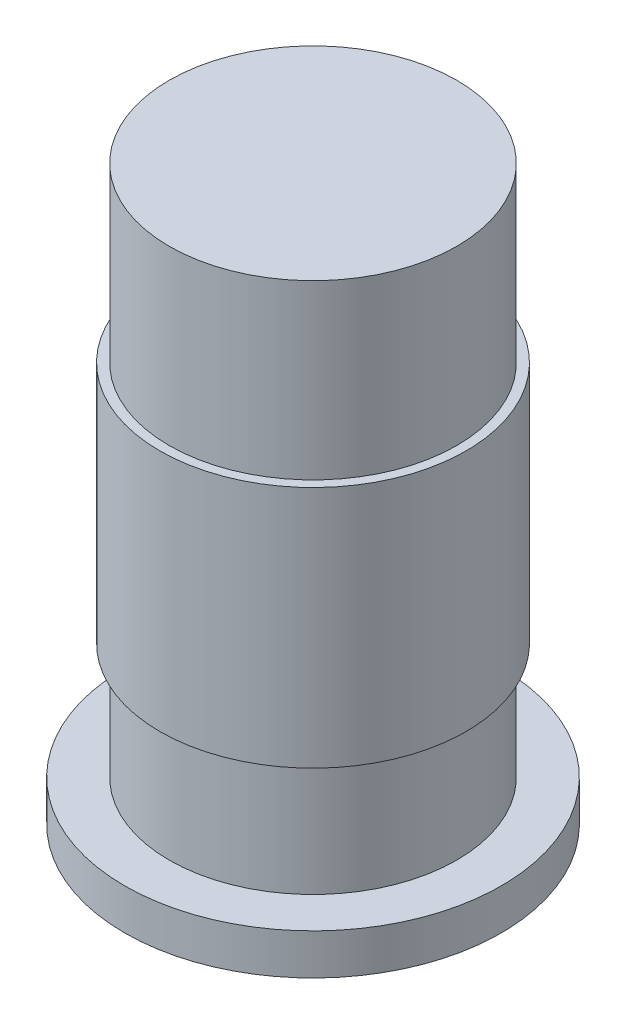
ISO-10303-21;
HEADER;
FILE_DESCRIPTION(('STEP AP214'),'2;1');
FILE_NAME('part.step','',(''),(''),'','','');
FILE_SCHEMA(('AUTOMOTIVE_DESIGN { 1 0 10303 214 1 1 1 1 }'));
ENDSEC;
DATA;
#1=APPLICATION_CONTEXT('core data for automotive mechanical design processes');
#2=APPLICATION_PROTOCOL_DEFINITION('international standard','automotive_design',2000,#1);
#3=PRODUCT_CONTEXT('',#1,'mechanical');
#4=PRODUCT('Part','Part','',(#3));
#5=PRODUCT_RELATED_PRODUCT_CATEGORY('part','',(#4));
#6=PRODUCT_DEFINITION_FORMATION('','',#4);
#7=PRODUCT_DEFINITION_CONTEXT('part definition',#1,'design');
#8=PRODUCT_DEFINITION('design','',#6,#7);
#9=PRODUCT_DEFINITION_SHAPE('','',#8);
#10=(LENGTH_UNIT() NAMED_UNIT(*) SI_UNIT(.MILLI.,.METRE.));
#11=(NAMED_UNIT(*) PLANE_ANGLE_UNIT() SI_UNIT($,.RADIAN.));
#12=(NAMED_UNIT(*) SI_UNIT($,.STERADIAN.) SOLID_ANGLE_UNIT());
#13=UNCERTAINTY_MEASURE_WITH_UNIT(LENGTH_MEASURE(1.E-05),#10,'distance_accuracy_value','');
#14=(GEOMETRIC_REPRESENTATION_CONTEXT(3) GLOBAL_UNCERTAINTY_ASSIGNED_CONTEXT((#13)) GLOBAL_UNIT_ASSIGNED_CONTEXT((#10,
#11,#12)) REPRESENTATION_CONTEXT('',''));
#15=CARTESIAN_POINT('',(0.,0.,0.));
#16=DIRECTION('',(0.,0.,1.));
#17=DIRECTION('',(1.,0.,0.));
#18=AXIS2_PLACEMENT_3D('',#15,#16,#17);
#19=CARTESIAN_POINT('',(0.,308.5,0.));
#20=DIRECTION('',(0.,-1.,0.));
#21=DIRECTION('',(0.,0.,-1.));
#22=AXIS2_PLACEMENT_3D('',#19,#20,#21);
#23=CYLINDRICAL_SURFACE('',#22,77.5);
#24=CARTESIAN_POINT('',(0.,22.,0.));
#25=DIRECTION('',(0.,1.,0.));
#26=DIRECTION('',(0.,0.,1.));
#27=AXIS2_PLACEMENT_3D('',#24,#25,#26);
#28=CIRCLE('',#27,77.5);
#29=CARTESIAN_POINT('',(0.,22.,77.5));
#30=VERTEX_POINT('',#29);
#31=EDGE_CURVE('E46',#30,#30,#28,.T.);
#32=ORIENTED_EDGE('',*,*,#31,.T.);
#33=EDGE_LOOP('',(#32));
#34=FACE_BOUND('',#33,.T.);
#35=CARTESIAN_POINT('',(0.,84.5,0.));
#36=DIRECTION('',(0.,1.,0.));
#37=DIRECTION('',(0.,0.,1.));
#38=AXIS2_PLACEMENT_3D('',#35,#36,#37);
#39=CIRCLE('',#38,77.5);
#40=CARTESIAN_POINT('',(0.,84.5,77.5));
#41=VERTEX_POINT('',#40);
#42=EDGE_CURVE('E10',#41,#41,#39,.T.);
#43=ORIENTED_EDGE('',*,*,#42,.F.);
#44=EDGE_LOOP('',(#43));
#45=FACE_BOUND('',#44,.T.);
#46=ADVANCED_FACE('F37',(#34,#45),#23,.T.);
#47=CARTESIAN_POINT('',(0.,22.,0.));
#48=DIRECTION('',(0.,-1.,0.));
#49=DIRECTION('',(0.,0.,-1.));
#50=AXIS2_PLACEMENT_3D('',#47,#48,#49);
#51=CYLINDRICAL_SURFACE('',#50,101.5);
#52=CARTESIAN_POINT('',(0.,22.,0.));
#53=DIRECTION('',(0.,1.,0.));
#54=DIRECTION('',(0.,0.,1.));
#55=AXIS2_PLACEMENT_3D('',#52,#53,#54);
#56=CIRCLE('',#55,101.5);
#57=CARTESIAN_POINT('',(0.,22.,101.5));
#58=VERTEX_POINT('',#57);
#59=EDGE_CURVE('E51',#58,#58,#56,.T.);
#60=ORIENTED_EDGE('',*,*,#59,.F.);
#61=EDGE_LOOP('',(#60));
#62=FACE_BOUND('',#61,.T.);
#63=CARTESIAN_POINT('',(0.,0.,0.));
#64=DIRECTION('',(0.,1.,0.));
#65=DIRECTION('',(0.,0.,1.));
#66=AXIS2_PLACEMENT_3D('',#63,#64,#65);
#67=CIRCLE('',#66,101.5);
#68=CARTESIAN_POINT('',(0.,0.,101.5));
#69=VERTEX_POINT('',#68);
#70=EDGE_CURVE('E54',#69,#69,#67,.T.);
#71=ORIENTED_EDGE('',*,*,#70,.T.);
#72=EDGE_LOOP('',(#71));
#73=FACE_BOUND('',#72,.T.);
#74=ADVANCED_FACE('F39',(#62,#73),#51,.T.);
#75=CARTESIAN_POINT('',(0.,22.,0.));
#76=DIRECTION('',(0.,1.,0.));
#77=DIRECTION('',(0.,0.,1.));
#78=AXIS2_PLACEMENT_3D('',#75,#76,#77);
#79=PLANE('',#78);
#80=ORIENTED_EDGE('',*,*,#31,.F.);
#81=EDGE_LOOP('',(#80));
#82=FACE_BOUND('',#81,.T.);
#83=ORIENTED_EDGE('',*,*,#59,.T.);
#84=EDGE_LOOP('',(#83));
#85=FACE_BOUND('',#84,.T.);
#86=ADVANCED_FACE('F101',(#82,#85),#79,.T.);
#87=CARTESIAN_POINT('',(0.,0.,0.));
#88=DIRECTION('',(0.,1.,0.));
#89=DIRECTION('',(0.,0.,1.));
#90=AXIS2_PLACEMENT_3D('',#87,#88,#89);
#91=PLANE('',#90);
#92=ORIENTED_EDGE('',*,*,#70,.F.);
#93=EDGE_LOOP('',(#92));
#94=FACE_BOUND('',#93,.T.);
#95=ADVANCED_FACE('F92',(#94),#91,.F.);
#96=CARTESIAN_POINT('',(0.,215.5,0.));
#97=DIRECTION('',(0.,-1.,0.));
#98=DIRECTION('',(0.,0.,-1.));
#99=AXIS2_PLACEMENT_3D('',#96,#97,#98);
#100=CYLINDRICAL_SURFACE('',#99,82.5);
#101=CARTESIAN_POINT('',(0.,215.5,0.));
#102=DIRECTION('',(0.,1.,0.));
#103=DIRECTION('',(0.,0.,1.));
#104=AXIS2_PLACEMENT_3D('',#101,#102,#103);
#105=CIRCLE('',#104,82.5);
#106=CARTESIAN_POINT('',(0.,215.5,82.5));
#107=VERTEX_POINT('',#106);
#108=EDGE_CURVE('E69',#107,#107,#105,.T.);
#109=ORIENTED_EDGE('',*,*,#108,.F.);
#110=EDGE_LOOP('',(#109));
#111=FACE_BOUND('',#110,.T.);
#112=CARTESIAN_POINT('',(0.,84.5,0.));
#113=DIRECTION('',(0.,1.,0.));
#114=DIRECTION('',(0.,0.,1.));
#115=AXIS2_PLACEMENT_3D('',#112,#113,#114);
#116=CIRCLE('',#115,82.5);
#117=CARTESIAN_POINT('',(0.,84.5,82.5));
#118=VERTEX_POINT('',#117);
#119=EDGE_CURVE('E65',#118,#118,#116,.T.);
#120=ORIENTED_EDGE('',*,*,#119,.T.);
#121=EDGE_LOOP('',(#120));
#122=FACE_BOUND('',#121,.T.);
#123=ADVANCED_FACE('F84',(#111,#122),#100,.T.);
#124=CARTESIAN_POINT('',(0.,215.5,0.));
#125=DIRECTION('',(0.,1.,0.));
#126=DIRECTION('',(0.,0.,1.));
#127=AXIS2_PLACEMENT_3D('',#124,#125,#126);
#128=PLANE('',#127);
#129=CARTESIAN_POINT('',(0.,215.5,0.));
#130=DIRECTION('',(0.,1.,0.));
#131=DIRECTION('',(0.,0.,1.));
#132=AXIS2_PLACEMENT_3D('',#129,#130,#131);
#133=CIRCLE('',#132,77.5);
#134=CARTESIAN_POINT('',(0.,215.5,77.5));
#135=VERTEX_POINT('',#134);
#136=EDGE_CURVE('E41',#135,#135,#133,.T.);
#137=ORIENTED_EDGE('',*,*,#136,.F.);
#138=EDGE_LOOP('',(#137));
#139=FACE_BOUND('',#138,.T.);
#140=ORIENTED_EDGE('',*,*,#108,.T.);
#141=EDGE_LOOP('',(#140));
#142=FACE_BOUND('',#141,.T.);
#143=ADVANCED_FACE('F81',(#139,#142),#128,.T.);
#144=CARTESIAN_POINT('',(0.,84.5,0.));
#145=DIRECTION('',(0.,1.,0.));
#146=DIRECTION('',(0.,0.,1.));
#147=AXIS2_PLACEMENT_3D('',#144,#145,#146);
#148=PLANE('',#147);
#149=ORIENTED_EDGE('',*,*,#42,.T.);
#150=EDGE_LOOP('',(#149));
#151=FACE_BOUND('',#150,.T.);
#152=ORIENTED_EDGE('',*,*,#119,.F.);
#153=EDGE_LOOP('',(#152));
#154=FACE_BOUND('',#153,.T.);
#155=ADVANCED_FACE('F83',(#151,#154),#148,.F.);
#156=CARTESIAN_POINT('',(0.,308.5,0.));
#157=DIRECTION('',(0.,1.,0.));
#158=DIRECTION('',(0.,0.,1.));
#159=AXIS2_PLACEMENT_3D('',#156,#157,#158);
#160=PLANE('',#159);
#161=CARTESIAN_POINT('',(0.,308.5,0.));
#162=DIRECTION('',(0.,1.,0.));
#163=DIRECTION('',(0.,0.,1.));
#164=AXIS2_PLACEMENT_3D('',#161,#162,#163);
#165=CIRCLE('',#164,77.5);
#166=CARTESIAN_POINT('',(0.,308.5,77.5));
#167=VERTEX_POINT('',#166);
#168=EDGE_CURVE('E58',#167,#167,#165,.T.);
#169=ORIENTED_EDGE('',*,*,#168,.T.);
#170=EDGE_LOOP('',(#169));
#171=FACE_BOUND('',#170,.T.);
#172=ADVANCED_FACE('F90',(#171),#160,.T.);
#173=ORIENTED_EDGE('',*,*,#136,.T.);
#174=EDGE_LOOP('',(#173));
#175=FACE_BOUND('',#174,.T.);
#176=ORIENTED_EDGE('',*,*,#168,.F.);
#177=EDGE_LOOP('',(#176));
#178=FACE_BOUND('',#177,.T.);
#179=ADVANCED_FACE('F78',(#175,#178),#23,.T.);
#180=CLOSED_SHELL('',(#46,#74,#86,#95,#123,#143,#155,#172,#179));
#181=MANIFOLD_SOLID_BREP('B2',#180);
#182=ADVANCED_BREP_SHAPE_REPRESENTATION('',(#18,#181),#14);
#183=SHAPE_DEFINITION_REPRESENTATION(#9,#182);
ENDSEC;
END-ISO-10303-21;
